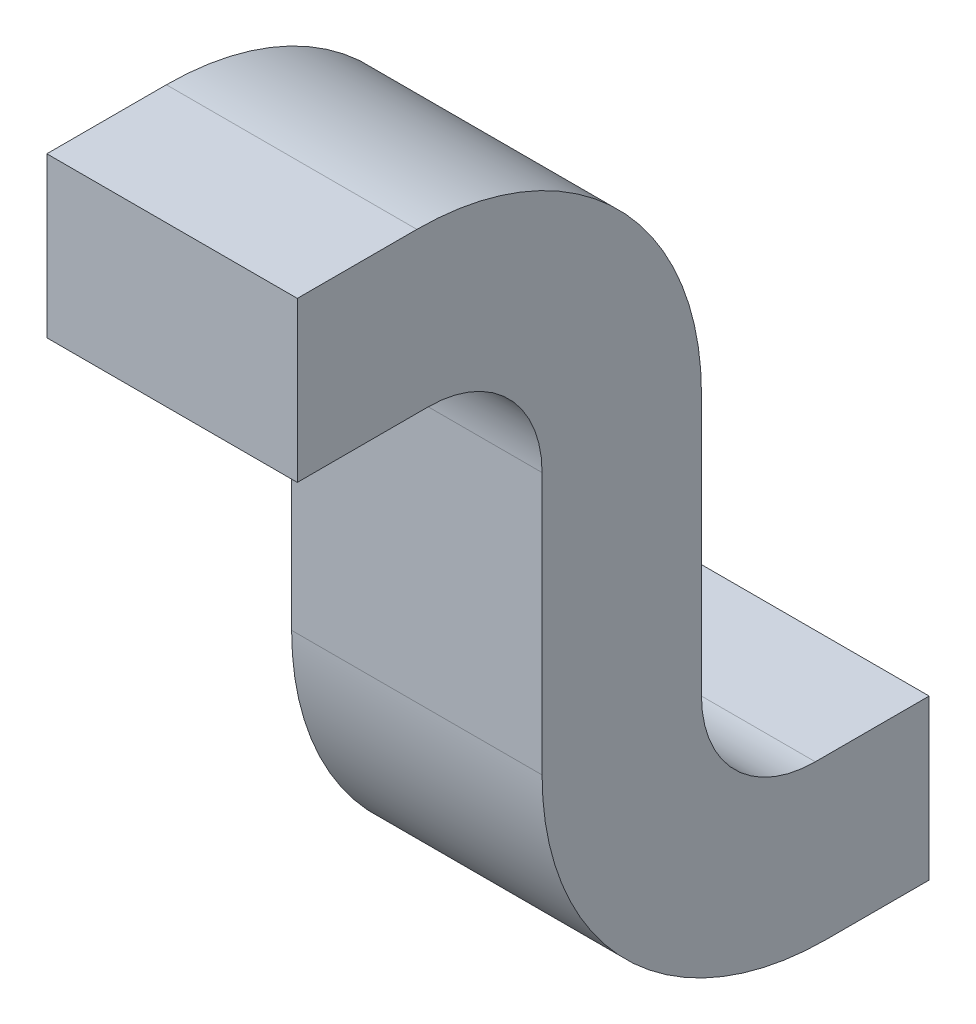
ISO-10303-21;
HEADER;
FILE_DESCRIPTION(('STEP AP214'),'2;1');
FILE_NAME('part.step','',(''),(''),'','','');
FILE_SCHEMA(('AUTOMOTIVE_DESIGN { 1 0 10303 214 1 1 1 1 }'));
ENDSEC;
DATA;
#1=APPLICATION_CONTEXT('core data for automotive mechanical design processes');
#2=APPLICATION_PROTOCOL_DEFINITION('international standard','automotive_design',2000,#1);
#3=PRODUCT_CONTEXT('',#1,'mechanical');
#4=PRODUCT('Part','Part','',(#3));
#5=PRODUCT_RELATED_PRODUCT_CATEGORY('part','',(#4));
#6=PRODUCT_DEFINITION_FORMATION('','',#4);
#7=PRODUCT_DEFINITION_CONTEXT('part definition',#1,'design');
#8=PRODUCT_DEFINITION('design','',#6,#7);
#9=PRODUCT_DEFINITION_SHAPE('','',#8);
#10=(LENGTH_UNIT() NAMED_UNIT(*) SI_UNIT(.MILLI.,.METRE.));
#11=(NAMED_UNIT(*) PLANE_ANGLE_UNIT() SI_UNIT($,.RADIAN.));
#12=(NAMED_UNIT(*) SI_UNIT($,.STERADIAN.) SOLID_ANGLE_UNIT());
#13=UNCERTAINTY_MEASURE_WITH_UNIT(LENGTH_MEASURE(1.E-05),#10,'distance_accuracy_value','');
#14=(GEOMETRIC_REPRESENTATION_CONTEXT(3) GLOBAL_UNCERTAINTY_ASSIGNED_CONTEXT((#13)) GLOBAL_UNIT_ASSIGNED_CONTEXT((#10,
#11,#12)) REPRESENTATION_CONTEXT('',''));
#15=CARTESIAN_POINT('',(0.,0.,0.));
#16=DIRECTION('',(0.,0.,1.));
#17=DIRECTION('',(1.,0.,0.));
#18=AXIS2_PLACEMENT_3D('',#15,#16,#17);
#19=CARTESIAN_POINT('',(-0.54,0.165,-0.545));
#20=DIRECTION('',(1.,0.,0.));
#21=DIRECTION('',(0.,1.,0.));
#22=AXIS2_PLACEMENT_3D('',#19,#20,#21);
#23=PLANE('',#22);
#24=CARTESIAN_POINT('',(-0.54,-0.235,-1.01));
#25=DIRECTION('',(1.,0.,0.));
#26=DIRECTION('',(0.,-1.,0.));
#27=AXIS2_PLACEMENT_3D('',#24,#25,#26);
#28=CIRCLE('',#27,0.25);
#29=CARTESIAN_POINT('',(-0.54,-0.235,-0.76));
#30=VERTEX_POINT('',#29);
#31=CARTESIAN_POINT('',(-0.54,-0.485,-1.01));
#32=VERTEX_POINT('',#31);
#33=EDGE_CURVE('E11',#30,#32,#28,.T.);
#34=ORIENTED_EDGE('',*,*,#33,.T.);
#35=DIRECTION('',(0.,0.,-1.));
#36=VECTOR('',#35,1.);
#37=CARTESIAN_POINT('',(-0.54,-0.485,-0.545));
#38=LINE('',#37,#36);
#39=CARTESIAN_POINT('',(-0.54,-0.485,-1.1));
#40=VERTEX_POINT('',#39);
#41=EDGE_CURVE('E165',#32,#40,#38,.T.);
#42=ORIENTED_EDGE('',*,*,#41,.T.);
#43=DIRECTION('',(0.,1.,0.));
#44=VECTOR('',#43,1.);
#45=CARTESIAN_POINT('',(-0.54,0.165,-1.1));
#46=LINE('',#45,#44);
#47=CARTESIAN_POINT('',(-0.54,-0.345,-1.1));
#48=VERTEX_POINT('',#47);
#49=EDGE_CURVE('E156',#40,#48,#46,.T.);
#50=ORIENTED_EDGE('',*,*,#49,.T.);
#51=DIRECTION('',(0.,0.,1.));
#52=VECTOR('',#51,1.);
#53=CARTESIAN_POINT('',(-0.54,-0.345,-0.545));
#54=LINE('',#53,#52);
#55=CARTESIAN_POINT('',(-0.54,-0.345,-1.));
#56=VERTEX_POINT('',#55);
#57=EDGE_CURVE('E213',#48,#56,#54,.T.);
#58=ORIENTED_EDGE('',*,*,#57,.T.);
#59=CARTESIAN_POINT('',(-0.54,-0.245,-1.));
#60=DIRECTION('',(-1.,0.,0.));
#61=DIRECTION('',(0.,-1.,0.));
#62=AXIS2_PLACEMENT_3D('',#59,#60,#61);
#63=CIRCLE('',#62,0.1);
#64=CARTESIAN_POINT('',(-0.54,-0.245,-0.9));
#65=VERTEX_POINT('',#64);
#66=EDGE_CURVE('E212',#56,#65,#63,.T.);
#67=ORIENTED_EDGE('',*,*,#66,.T.);
#68=DIRECTION('',(0.,1.,0.));
#69=VECTOR('',#68,1.);
#70=CARTESIAN_POINT('',(-0.54,0.165,-0.9));
#71=LINE('',#70,#69);
#72=CARTESIAN_POINT('',(-0.54,-0.01499999999999,-0.9));
#73=VERTEX_POINT('',#72);
#74=EDGE_CURVE('E248',#65,#73,#71,.T.);
#75=ORIENTED_EDGE('',*,*,#74,.T.);
#76=CARTESIAN_POINT('',(-0.54,-0.01499999999999,-0.65));
#77=DIRECTION('',(1.,0.,0.));
#78=DIRECTION('',(0.,-1.,0.));
#79=AXIS2_PLACEMENT_3D('',#76,#77,#78);
#80=CIRCLE('',#79,0.25);
#81=CARTESIAN_POINT('',(-0.54,0.235,-0.65));
#82=VERTEX_POINT('',#81);
#83=EDGE_CURVE('E228',#73,#82,#80,.T.);
#84=ORIENTED_EDGE('',*,*,#83,.T.);
#85=DIRECTION('',(0.,0.,1.));
#86=VECTOR('',#85,1.);
#87=CARTESIAN_POINT('',(-0.54,0.235,-0.545));
#88=LINE('',#87,#86);
#89=CARTESIAN_POINT('',(-0.54,0.235,-0.545));
#90=VERTEX_POINT('',#89);
#91=EDGE_CURVE('E92',#82,#90,#88,.T.);
#92=ORIENTED_EDGE('',*,*,#91,.T.);
#93=DIRECTION('',(0.,-1.,0.));
#94=VECTOR('',#93,1.);
#95=CARTESIAN_POINT('',(-0.54,0.165,-0.545));
#96=LINE('',#95,#94);
#97=CARTESIAN_POINT('',(-0.54,0.09500000000001,-0.545));
#98=VERTEX_POINT('',#97);
#99=EDGE_CURVE('E80',#90,#98,#96,.T.);
#100=ORIENTED_EDGE('',*,*,#99,.T.);
#101=DIRECTION('',(0.,0.,-1.));
#102=VECTOR('',#101,1.);
#103=CARTESIAN_POINT('',(-0.54,0.09500000000001,-0.545));
#104=LINE('',#103,#102);
#105=CARTESIAN_POINT('',(-0.54,0.09500000000001,-0.66));
#106=VERTEX_POINT('',#105);
#107=EDGE_CURVE('E71',#98,#106,#104,.T.);
#108=ORIENTED_EDGE('',*,*,#107,.T.);
#109=CARTESIAN_POINT('',(-0.54,-0.004999999999992,-0.66));
#110=DIRECTION('',(-1.,0.,0.));
#111=DIRECTION('',(0.,-1.,0.));
#112=AXIS2_PLACEMENT_3D('',#109,#110,#111);
#113=CIRCLE('',#112,0.1);
#114=CARTESIAN_POINT('',(-0.54,-0.004999999999989,-0.76));
#115=VERTEX_POINT('',#114);
#116=EDGE_CURVE('E238',#106,#115,#113,.T.);
#117=ORIENTED_EDGE('',*,*,#116,.T.);
#118=DIRECTION('',(0.,-1.,0.));
#119=VECTOR('',#118,1.);
#120=CARTESIAN_POINT('',(-0.54,0.165,-0.76));
#121=LINE('',#120,#119);
#122=EDGE_CURVE('E27',#115,#30,#121,.T.);
#123=ORIENTED_EDGE('',*,*,#122,.T.);
#124=EDGE_LOOP('',(#34,#42,#50,#58,#67,#75,#84,#92,#100,#108,#117,#123));
#125=FACE_BOUND('',#124,.T.);
#126=ADVANCED_FACE('F16',(#125),#23,.T.);
#127=CARTESIAN_POINT('',(-0.76,-0.235,-1.01));
#128=DIRECTION('',(-1.,0.,0.));
#129=DIRECTION('',(0.,-1.,0.));
#130=AXIS2_PLACEMENT_3D('',#127,#128,#129);
#131=CYLINDRICAL_SURFACE('',#130,0.25);
#132=DIRECTION('',(1.,0.,0.));
#133=VECTOR('',#132,1.);
#134=CARTESIAN_POINT('',(-0.76,-0.485,-1.01));
#135=LINE('',#134,#133);
#136=CARTESIAN_POINT('',(-0.76,-0.485,-1.01));
#137=VERTEX_POINT('',#136);
#138=EDGE_CURVE('E145',#137,#32,#135,.T.);
#139=ORIENTED_EDGE('',*,*,#138,.T.);
#140=ORIENTED_EDGE('',*,*,#33,.F.);
#141=DIRECTION('',(-1.,0.,0.));
#142=VECTOR('',#141,1.);
#143=CARTESIAN_POINT('',(-0.76,-0.235,-0.76));
#144=LINE('',#143,#142);
#145=CARTESIAN_POINT('',(-0.76,-0.235,-0.76));
#146=VERTEX_POINT('',#145);
#147=EDGE_CURVE('E216',#30,#146,#144,.T.);
#148=ORIENTED_EDGE('',*,*,#147,.T.);
#149=CARTESIAN_POINT('',(-0.76,-0.235,-1.01));
#150=DIRECTION('',(1.,0.,0.));
#151=DIRECTION('',(0.,-1.,0.));
#152=AXIS2_PLACEMENT_3D('',#149,#150,#151);
#153=CIRCLE('',#152,0.25);
#154=EDGE_CURVE('E194',#146,#137,#153,.T.);
#155=ORIENTED_EDGE('',*,*,#154,.T.);
#156=EDGE_LOOP('',(#139,#140,#148,#155));
#157=FACE_BOUND('',#156,.T.);
#158=ADVANCED_FACE('F315',(#157),#131,.T.);
#159=CARTESIAN_POINT('',(-0.76,-0.12,-0.76));
#160=DIRECTION('',(0.,0.,1.));
#161=DIRECTION('',(0.,-1.,0.));
#162=AXIS2_PLACEMENT_3D('',#159,#160,#161);
#163=PLANE('',#162);
#164=DIRECTION('',(0.,-1.,0.));
#165=VECTOR('',#164,1.);
#166=CARTESIAN_POINT('',(-0.76,-0.12,-0.76));
#167=LINE('',#166,#165);
#168=CARTESIAN_POINT('',(-0.76,-0.004999999999997,-0.76));
#169=VERTEX_POINT('',#168);
#170=EDGE_CURVE('E197',#169,#146,#167,.T.);
#171=ORIENTED_EDGE('',*,*,#170,.T.);
#172=ORIENTED_EDGE('',*,*,#147,.F.);
#173=ORIENTED_EDGE('',*,*,#122,.F.);
#174=DIRECTION('',(-1.,0.,0.));
#175=VECTOR('',#174,1.);
#176=CARTESIAN_POINT('',(-0.76,-0.004999999999986,-0.76));
#177=LINE('',#176,#175);
#178=EDGE_CURVE('E242',#115,#169,#177,.T.);
#179=ORIENTED_EDGE('',*,*,#178,.T.);
#180=EDGE_LOOP('',(#171,#172,#173,#179));
#181=FACE_BOUND('',#180,.T.);
#182=ADVANCED_FACE('F320',(#181),#163,.T.);
#183=CARTESIAN_POINT('',(-0.76,-0.005000000000009,-0.66));
#184=DIRECTION('',(-1.,0.,0.));
#185=DIRECTION('',(0.,-1.,0.));
#186=AXIS2_PLACEMENT_3D('',#183,#184,#185);
#187=CYLINDRICAL_SURFACE('',#186,0.1);
#188=DIRECTION('',(1.,0.,0.));
#189=VECTOR('',#188,1.);
#190=CARTESIAN_POINT('',(-0.76,0.09499999999999,-0.66));
#191=LINE('',#190,#189);
#192=CARTESIAN_POINT('',(-0.76,0.09499999999999,-0.66));
#193=VERTEX_POINT('',#192);
#194=EDGE_CURVE('E183',#193,#106,#191,.T.);
#195=ORIENTED_EDGE('',*,*,#194,.F.);
#196=CARTESIAN_POINT('',(-0.76,-0.005000000000009,-0.66));
#197=DIRECTION('',(1.,0.,0.));
#198=DIRECTION('',(0.,-1.,0.));
#199=AXIS2_PLACEMENT_3D('',#196,#197,#198);
#200=CIRCLE('',#199,0.1);
#201=EDGE_CURVE('E208',#169,#193,#200,.T.);
#202=ORIENTED_EDGE('',*,*,#201,.F.);
#203=ORIENTED_EDGE('',*,*,#178,.F.);
#204=ORIENTED_EDGE('',*,*,#116,.F.);
#205=EDGE_LOOP('',(#195,#202,#203,#204));
#206=FACE_BOUND('',#205,.T.);
#207=ADVANCED_FACE('F18',(#206),#187,.F.);
#208=CARTESIAN_POINT('',(-0.76,0.09499999999999,-0.6025));
#209=DIRECTION('',(0.,-1.,0.));
#210=DIRECTION('',(0.,0.,-1.));
#211=AXIS2_PLACEMENT_3D('',#208,#209,#210);
#212=PLANE('',#211);
#213=DIRECTION('',(0.,0.,-1.));
#214=VECTOR('',#213,1.);
#215=CARTESIAN_POINT('',(-0.76,0.09499999999999,-0.6025));
#216=LINE('',#215,#214);
#217=CARTESIAN_POINT('',(-0.76,0.09499999999999,-0.545));
#218=VERTEX_POINT('',#217);
#219=EDGE_CURVE('E202',#218,#193,#216,.T.);
#220=ORIENTED_EDGE('',*,*,#219,.T.);
#221=ORIENTED_EDGE('',*,*,#194,.T.);
#222=ORIENTED_EDGE('',*,*,#107,.F.);
#223=DIRECTION('',(-1.,0.,0.));
#224=VECTOR('',#223,1.);
#225=CARTESIAN_POINT('',(-0.76,0.09499999999999,-0.545));
#226=LINE('',#225,#224);
#227=EDGE_CURVE('E186',#98,#218,#226,.T.);
#228=ORIENTED_EDGE('',*,*,#227,.T.);
#229=EDGE_LOOP('',(#220,#221,#222,#228));
#230=FACE_BOUND('',#229,.T.);
#231=ADVANCED_FACE('F300',(#230),#212,.T.);
#232=CARTESIAN_POINT('',(-0.76,0.165,-0.545));
#233=DIRECTION('',(0.,0.,1.));
#234=DIRECTION('',(0.,-1.,0.));
#235=AXIS2_PLACEMENT_3D('',#232,#233,#234);
#236=PLANE('',#235);
#237=DIRECTION('',(0.,-1.,0.));
#238=VECTOR('',#237,1.);
#239=CARTESIAN_POINT('',(-0.76,0.165,-0.545));
#240=LINE('',#239,#238);
#241=CARTESIAN_POINT('',(-0.76,0.235,-0.545));
#242=VERTEX_POINT('',#241);
#243=EDGE_CURVE('E198',#242,#218,#240,.T.);
#244=ORIENTED_EDGE('',*,*,#243,.T.);
#245=ORIENTED_EDGE('',*,*,#227,.F.);
#246=ORIENTED_EDGE('',*,*,#99,.F.);
#247=DIRECTION('',(-1.,0.,0.));
#248=VECTOR('',#247,1.);
#249=CARTESIAN_POINT('',(-0.76,0.235,-0.545));
#250=LINE('',#249,#248);
#251=EDGE_CURVE('E225',#90,#242,#250,.T.);
#252=ORIENTED_EDGE('',*,*,#251,.T.);
#253=EDGE_LOOP('',(#244,#245,#246,#252));
#254=FACE_BOUND('',#253,.T.);
#255=ADVANCED_FACE('F301',(#254),#236,.T.);
#256=CARTESIAN_POINT('',(-0.76,0.235,-0.5975));
#257=DIRECTION('',(0.,1.,0.));
#258=DIRECTION('',(1.,0.,0.));
#259=AXIS2_PLACEMENT_3D('',#256,#257,#258);
#260=PLANE('',#259);
#261=DIRECTION('',(0.,0.,1.));
#262=VECTOR('',#261,1.);
#263=CARTESIAN_POINT('',(-0.76,0.235,-0.5975));
#264=LINE('',#263,#262);
#265=CARTESIAN_POINT('',(-0.76,0.235,-0.65));
#266=VERTEX_POINT('',#265);
#267=EDGE_CURVE('E193',#266,#242,#264,.T.);
#268=ORIENTED_EDGE('',*,*,#267,.T.);
#269=ORIENTED_EDGE('',*,*,#251,.F.);
#270=ORIENTED_EDGE('',*,*,#91,.F.);
#271=DIRECTION('',(-1.,0.,0.));
#272=VECTOR('',#271,1.);
#273=CARTESIAN_POINT('',(-0.76,0.235,-0.65));
#274=LINE('',#273,#272);
#275=EDGE_CURVE('E20',#82,#266,#274,.T.);
#276=ORIENTED_EDGE('',*,*,#275,.T.);
#277=EDGE_LOOP('',(#268,#269,#270,#276));
#278=FACE_BOUND('',#277,.T.);
#279=ADVANCED_FACE('F302',(#278),#260,.T.);
#280=CARTESIAN_POINT('',(-0.76,-0.01500000000001,-0.65));
#281=DIRECTION('',(-1.,0.,0.));
#282=DIRECTION('',(0.,-1.,0.));
#283=AXIS2_PLACEMENT_3D('',#280,#281,#282);
#284=CYLINDRICAL_SURFACE('',#283,0.25);
#285=ORIENTED_EDGE('',*,*,#275,.F.);
#286=ORIENTED_EDGE('',*,*,#83,.F.);
#287=DIRECTION('',(-1.,0.,0.));
#288=VECTOR('',#287,1.);
#289=CARTESIAN_POINT('',(-0.76,-0.015,-0.9));
#290=LINE('',#289,#288);
#291=CARTESIAN_POINT('',(-0.76,-0.015,-0.9));
#292=VERTEX_POINT('',#291);
#293=EDGE_CURVE('E220',#73,#292,#290,.T.);
#294=ORIENTED_EDGE('',*,*,#293,.T.);
#295=CARTESIAN_POINT('',(-0.76,-0.01500000000001,-0.65));
#296=DIRECTION('',(1.,0.,0.));
#297=DIRECTION('',(0.,-1.,0.));
#298=AXIS2_PLACEMENT_3D('',#295,#296,#297);
#299=CIRCLE('',#298,0.25);
#300=EDGE_CURVE('E189',#292,#266,#299,.T.);
#301=ORIENTED_EDGE('',*,*,#300,.T.);
#302=EDGE_LOOP('',(#285,#286,#294,#301));
#303=FACE_BOUND('',#302,.T.);
#304=ADVANCED_FACE('F261',(#303),#284,.T.);
#305=CARTESIAN_POINT('',(-0.76,-0.13,-0.9));
#306=DIRECTION('',(0.,0.,-1.));
#307=DIRECTION('',(-1.,0.,0.));
#308=AXIS2_PLACEMENT_3D('',#305,#306,#307);
#309=PLANE('',#308);
#310=DIRECTION('',(0.,1.,0.));
#311=VECTOR('',#310,1.);
#312=CARTESIAN_POINT('',(-0.76,-0.13,-0.9));
#313=LINE('',#312,#311);
#314=CARTESIAN_POINT('',(-0.76,-0.245,-0.9));
#315=VERTEX_POINT('',#314);
#316=EDGE_CURVE('E180',#315,#292,#313,.T.);
#317=ORIENTED_EDGE('',*,*,#316,.T.);
#318=ORIENTED_EDGE('',*,*,#293,.F.);
#319=ORIENTED_EDGE('',*,*,#74,.F.);
#320=DIRECTION('',(-1.,0.,0.));
#321=VECTOR('',#320,1.);
#322=CARTESIAN_POINT('',(-0.76,-0.245,-0.9));
#323=LINE('',#322,#321);
#324=EDGE_CURVE('E209',#65,#315,#323,.T.);
#325=ORIENTED_EDGE('',*,*,#324,.T.);
#326=EDGE_LOOP('',(#317,#318,#319,#325));
#327=FACE_BOUND('',#326,.T.);
#328=ADVANCED_FACE('F267',(#327),#309,.T.);
#329=CARTESIAN_POINT('',(-0.76,-0.245,-1.));
#330=DIRECTION('',(-1.,0.,0.));
#331=DIRECTION('',(0.,-1.,0.));
#332=AXIS2_PLACEMENT_3D('',#329,#330,#331);
#333=CYLINDRICAL_SURFACE('',#332,0.1);
#334=DIRECTION('',(1.,0.,0.));
#335=VECTOR('',#334,1.);
#336=CARTESIAN_POINT('',(-0.76,-0.345,-1.));
#337=LINE('',#336,#335);
#338=CARTESIAN_POINT('',(-0.76,-0.345,-1.));
#339=VERTEX_POINT('',#338);
#340=EDGE_CURVE('E163',#339,#56,#337,.T.);
#341=ORIENTED_EDGE('',*,*,#340,.F.);
#342=CARTESIAN_POINT('',(-0.76,-0.245,-1.));
#343=DIRECTION('',(1.,0.,0.));
#344=DIRECTION('',(0.,-1.,0.));
#345=AXIS2_PLACEMENT_3D('',#342,#343,#344);
#346=CIRCLE('',#345,0.1);
#347=EDGE_CURVE('E221',#315,#339,#346,.T.);
#348=ORIENTED_EDGE('',*,*,#347,.F.);
#349=ORIENTED_EDGE('',*,*,#324,.F.);
#350=ORIENTED_EDGE('',*,*,#66,.F.);
#351=EDGE_LOOP('',(#341,#348,#349,#350));
#352=FACE_BOUND('',#351,.T.);
#353=ADVANCED_FACE('F327',(#352),#333,.F.);
#354=CARTESIAN_POINT('',(-0.76,-0.345,-1.05));
#355=DIRECTION('',(0.,1.,0.));
#356=DIRECTION('',(1.,0.,0.));
#357=AXIS2_PLACEMENT_3D('',#354,#355,#356);
#358=PLANE('',#357);
#359=DIRECTION('',(0.,0.,1.));
#360=VECTOR('',#359,1.);
#361=CARTESIAN_POINT('',(-0.76,-0.345,-1.05));
#362=LINE('',#361,#360);
#363=CARTESIAN_POINT('',(-0.76,-0.345,-1.1));
#364=VERTEX_POINT('',#363);
#365=EDGE_CURVE('E177',#364,#339,#362,.T.);
#366=ORIENTED_EDGE('',*,*,#365,.T.);
#367=ORIENTED_EDGE('',*,*,#340,.T.);
#368=ORIENTED_EDGE('',*,*,#57,.F.);
#369=DIRECTION('',(-1.,0.,0.));
#370=VECTOR('',#369,1.);
#371=CARTESIAN_POINT('',(-0.76,-0.345,-1.1));
#372=LINE('',#371,#370);
#373=EDGE_CURVE('E159',#48,#364,#372,.T.);
#374=ORIENTED_EDGE('',*,*,#373,.T.);
#375=EDGE_LOOP('',(#366,#367,#368,#374));
#376=FACE_BOUND('',#375,.T.);
#377=ADVANCED_FACE('F326',(#376),#358,.T.);
#378=CARTESIAN_POINT('',(-0.76,-0.415,-1.1));
#379=DIRECTION('',(0.,0.,-1.));
#380=DIRECTION('',(-1.,0.,0.));
#381=AXIS2_PLACEMENT_3D('',#378,#379,#380);
#382=PLANE('',#381);
#383=DIRECTION('',(0.,1.,0.));
#384=VECTOR('',#383,1.);
#385=CARTESIAN_POINT('',(-0.76,-0.415,-1.1));
#386=LINE('',#385,#384);
#387=CARTESIAN_POINT('',(-0.76,-0.485,-1.1));
#388=VERTEX_POINT('',#387);
#389=EDGE_CURVE('E171',#388,#364,#386,.T.);
#390=ORIENTED_EDGE('',*,*,#389,.T.);
#391=ORIENTED_EDGE('',*,*,#373,.F.);
#392=ORIENTED_EDGE('',*,*,#49,.F.);
#393=DIRECTION('',(-1.,0.,0.));
#394=VECTOR('',#393,1.);
#395=CARTESIAN_POINT('',(-0.76,-0.485,-1.1));
#396=LINE('',#395,#394);
#397=EDGE_CURVE('E132',#40,#388,#396,.T.);
#398=ORIENTED_EDGE('',*,*,#397,.T.);
#399=EDGE_LOOP('',(#390,#391,#392,#398));
#400=FACE_BOUND('',#399,.T.);
#401=ADVANCED_FACE('F158',(#400),#382,.T.);
#402=CARTESIAN_POINT('',(-0.76,-0.485,-1.055));
#403=DIRECTION('',(0.,-1.,0.));
#404=DIRECTION('',(0.,0.,-1.));
#405=AXIS2_PLACEMENT_3D('',#402,#403,#404);
#406=PLANE('',#405);
#407=DIRECTION('',(0.,0.,-1.));
#408=VECTOR('',#407,1.);
#409=CARTESIAN_POINT('',(-0.76,-0.485,-1.055));
#410=LINE('',#409,#408);
#411=EDGE_CURVE('E169',#137,#388,#410,.T.);
#412=ORIENTED_EDGE('',*,*,#411,.T.);
#413=ORIENTED_EDGE('',*,*,#397,.F.);
#414=ORIENTED_EDGE('',*,*,#41,.F.);
#415=ORIENTED_EDGE('',*,*,#138,.F.);
#416=EDGE_LOOP('',(#412,#413,#414,#415));
#417=FACE_BOUND('',#416,.T.);
#418=ADVANCED_FACE('F167',(#417),#406,.T.);
#419=CARTESIAN_POINT('',(-0.76,-0.121132572617,-0.825365755119));
#420=DIRECTION('',(1.,0.,0.));
#421=DIRECTION('',(0.,0.,1.));
#422=AXIS2_PLACEMENT_3D('',#419,#420,#421);
#423=PLANE('',#422);
#424=ORIENTED_EDGE('',*,*,#411,.F.);
#425=ORIENTED_EDGE('',*,*,#154,.F.);
#426=ORIENTED_EDGE('',*,*,#170,.F.);
#427=ORIENTED_EDGE('',*,*,#201,.T.);
#428=ORIENTED_EDGE('',*,*,#219,.F.);
#429=ORIENTED_EDGE('',*,*,#243,.F.);
#430=ORIENTED_EDGE('',*,*,#267,.F.);
#431=ORIENTED_EDGE('',*,*,#300,.F.);
#432=ORIENTED_EDGE('',*,*,#316,.F.);
#433=ORIENTED_EDGE('',*,*,#347,.T.);
#434=ORIENTED_EDGE('',*,*,#365,.F.);
#435=ORIENTED_EDGE('',*,*,#389,.F.);
#436=EDGE_LOOP('',(#424,#425,#426,#427,#428,#429,#430,#431,#432,#433,#434,#435));
#437=FACE_BOUND('',#436,.T.);
#438=ADVANCED_FACE('F272',(#437),#423,.F.);
#439=CLOSED_SHELL('',(#126,#158,#182,#207,#231,#255,#279,#304,#328,#353,#377,#401,#418,#438));
#440=MANIFOLD_SOLID_BREP('B1',#439);
#441=ADVANCED_BREP_SHAPE_REPRESENTATION('',(#18,#440),#14);
#442=SHAPE_DEFINITION_REPRESENTATION(#9,#441);
ENDSEC;
END-ISO-10303-21;
